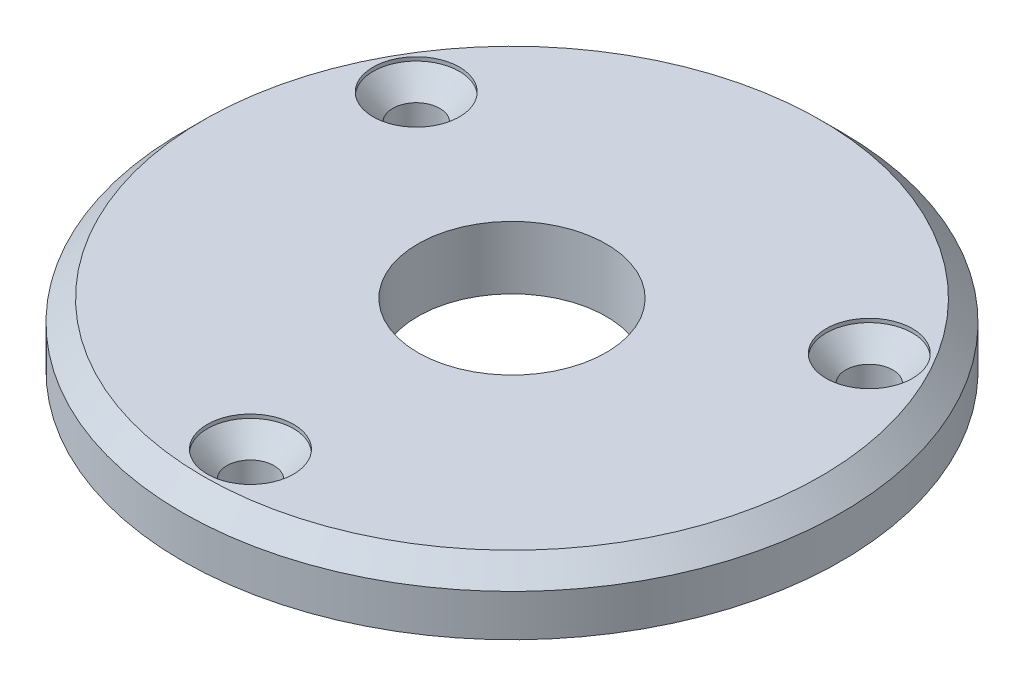
ISO-10303-21;
HEADER;
FILE_DESCRIPTION(('STEP AP214'),'2;1');
FILE_NAME('part.step','',(''),(''),'','','');
FILE_SCHEMA(('AUTOMOTIVE_DESIGN { 1 0 10303 214 1 1 1 1 }'));
ENDSEC;
DATA;
#1=APPLICATION_CONTEXT('core data for automotive mechanical design processes');
#2=APPLICATION_PROTOCOL_DEFINITION('international standard','automotive_design',2000,#1);
#3=PRODUCT_CONTEXT('',#1,'mechanical');
#4=PRODUCT('Part','Part','',(#3));
#5=PRODUCT_RELATED_PRODUCT_CATEGORY('part','',(#4));
#6=PRODUCT_DEFINITION_FORMATION('','',#4);
#7=PRODUCT_DEFINITION_CONTEXT('part definition',#1,'design');
#8=PRODUCT_DEFINITION('design','',#6,#7);
#9=PRODUCT_DEFINITION_SHAPE('','',#8);
#10=(LENGTH_UNIT() NAMED_UNIT(*) SI_UNIT(.MILLI.,.METRE.));
#11=(NAMED_UNIT(*) PLANE_ANGLE_UNIT() SI_UNIT($,.RADIAN.));
#12=(NAMED_UNIT(*) SI_UNIT($,.STERADIAN.) SOLID_ANGLE_UNIT());
#13=UNCERTAINTY_MEASURE_WITH_UNIT(LENGTH_MEASURE(1.E-05),#10,'distance_accuracy_value','');
#14=(GEOMETRIC_REPRESENTATION_CONTEXT(3) GLOBAL_UNCERTAINTY_ASSIGNED_CONTEXT((#13)) GLOBAL_UNIT_ASSIGNED_CONTEXT((#10,
#11,#12)) REPRESENTATION_CONTEXT('',''));
#15=CARTESIAN_POINT('',(0.,0.,0.));
#16=DIRECTION('',(0.,0.,1.));
#17=DIRECTION('',(1.,0.,0.));
#18=AXIS2_PLACEMENT_3D('',#15,#16,#17);
#19=CARTESIAN_POINT('',(0.,6.,0.));
#20=DIRECTION('',(0.,1.,0.));
#21=DIRECTION('',(0.,0.,1.));
#22=AXIS2_PLACEMENT_3D('',#19,#20,#21);
#23=PLANE('',#22);
#24=CARTESIAN_POINT('',(21.6506350946111,6.,-12.4999999999998));
#25=DIRECTION('',(0.,-1.,0.));
#26=DIRECTION('',(-0.866025403784443,0.,0.499999999999992));
#27=AXIS2_PLACEMENT_3D('',#24,#25,#26);
#28=CIRCLE('',#27,4.125);
#29=CARTESIAN_POINT('',(18.0782803040003,6.,-10.4374999999998));
#30=VERTEX_POINT('',#29);
#31=EDGE_CURVE('E85',#30,#30,#28,.T.);
#32=ORIENTED_EDGE('',*,*,#31,.T.);
#33=EDGE_LOOP('',(#32));
#34=FACE_BOUND('',#33,.T.);
#35=CARTESIAN_POINT('',(-21.6506350946109,6.,-12.5000000000001));
#36=DIRECTION('',(0.,-1.,0.));
#37=DIRECTION('',(0.866025403784436,0.,0.500000000000004));
#38=AXIS2_PLACEMENT_3D('',#35,#36,#37);
#39=CIRCLE('',#38,4.125);
#40=CARTESIAN_POINT('',(-18.0782803040001,6.,-10.4375000000001));
#41=VERTEX_POINT('',#40);
#42=EDGE_CURVE('E73',#41,#41,#39,.T.);
#43=ORIENTED_EDGE('',*,*,#42,.T.);
#44=EDGE_LOOP('',(#43));
#45=FACE_BOUND('',#44,.T.);
#46=CARTESIAN_POINT('',(0.,6.,25.));
#47=DIRECTION('',(0.,-1.,0.));
#48=DIRECTION('',(0.,0.,-1.));
#49=AXIS2_PLACEMENT_3D('',#46,#47,#48);
#50=CIRCLE('',#49,4.125);
#51=CARTESIAN_POINT('',(0.,6.,20.875));
#52=VERTEX_POINT('',#51);
#53=EDGE_CURVE('E53',#52,#52,#50,.T.);
#54=ORIENTED_EDGE('',*,*,#53,.T.);
#55=EDGE_LOOP('',(#54));
#56=FACE_BOUND('',#55,.T.);
#57=CARTESIAN_POINT('',(0.,6.,0.));
#58=DIRECTION('',(0.,1.,0.));
#59=DIRECTION('',(0.,0.,1.));
#60=AXIS2_PLACEMENT_3D('',#57,#58,#59);
#61=CIRCLE('',#60,29.5);
#62=CARTESIAN_POINT('',(0.,6.,29.5));
#63=VERTEX_POINT('',#62);
#64=EDGE_CURVE('E39',#63,#63,#61,.T.);
#65=ORIENTED_EDGE('',*,*,#64,.T.);
#66=EDGE_LOOP('',(#65));
#67=FACE_BOUND('',#66,.T.);
#68=CARTESIAN_POINT('',(0.,6.,0.));
#69=DIRECTION('',(0.,1.,0.));
#70=DIRECTION('',(0.,0.,1.));
#71=AXIS2_PLACEMENT_3D('',#68,#69,#70);
#72=CIRCLE('',#71,9.);
#73=CARTESIAN_POINT('',(0.,6.,9.));
#74=VERTEX_POINT('',#73);
#75=EDGE_CURVE('E47',#74,#74,#72,.T.);
#76=ORIENTED_EDGE('',*,*,#75,.F.);
#77=EDGE_LOOP('',(#76));
#78=FACE_BOUND('',#77,.T.);
#79=ADVANCED_FACE('F32',(#34,#45,#56,#67,#78),#23,.T.);
#80=CARTESIAN_POINT('',(0.,0.,0.));
#81=DIRECTION('',(0.,1.,0.));
#82=DIRECTION('',(0.,0.,1.));
#83=AXIS2_PLACEMENT_3D('',#80,#81,#82);
#84=PLANE('',#83);
#85=CARTESIAN_POINT('',(21.6506350946111,0.,-12.4999999999998));
#86=DIRECTION('',(0.,-1.,0.));
#87=DIRECTION('',(-0.866025403784443,0.,0.499999999999992));
#88=AXIS2_PLACEMENT_3D('',#85,#86,#87);
#89=CIRCLE('',#88,2.25);
#90=CARTESIAN_POINT('',(19.7020779360961,0.,-11.3749999999998));
#91=VERTEX_POINT('',#90);
#92=EDGE_CURVE('E88',#91,#91,#89,.T.);
#93=ORIENTED_EDGE('',*,*,#92,.F.);
#94=EDGE_LOOP('',(#93));
#95=FACE_BOUND('',#94,.T.);
#96=CARTESIAN_POINT('',(-21.6506350946109,0.,-12.5000000000001));
#97=DIRECTION('',(0.,-1.,0.));
#98=DIRECTION('',(0.866025403784436,0.,0.500000000000004));
#99=AXIS2_PLACEMENT_3D('',#96,#97,#98);
#100=CIRCLE('',#99,2.25);
#101=CARTESIAN_POINT('',(-19.7020779360959,0.,-11.3750000000001));
#102=VERTEX_POINT('',#101);
#103=EDGE_CURVE('E76',#102,#102,#100,.T.);
#104=ORIENTED_EDGE('',*,*,#103,.F.);
#105=EDGE_LOOP('',(#104));
#106=FACE_BOUND('',#105,.T.);
#107=CARTESIAN_POINT('',(0.,0.,25.));
#108=DIRECTION('',(0.,-1.,0.));
#109=DIRECTION('',(0.,0.,-1.));
#110=AXIS2_PLACEMENT_3D('',#107,#108,#109);
#111=CIRCLE('',#110,2.25);
#112=CARTESIAN_POINT('',(0.,0.,22.75));
#113=VERTEX_POINT('',#112);
#114=EDGE_CURVE('E64',#113,#113,#111,.T.);
#115=ORIENTED_EDGE('',*,*,#114,.F.);
#116=EDGE_LOOP('',(#115));
#117=FACE_BOUND('',#116,.T.);
#118=CARTESIAN_POINT('',(0.,0.,0.));
#119=DIRECTION('',(0.,1.,0.));
#120=DIRECTION('',(0.,0.,1.));
#121=AXIS2_PLACEMENT_3D('',#118,#119,#120);
#122=CIRCLE('',#121,31.5);
#123=CARTESIAN_POINT('',(0.,0.,31.5));
#124=VERTEX_POINT('',#123);
#125=EDGE_CURVE('E43',#124,#124,#122,.T.);
#126=ORIENTED_EDGE('',*,*,#125,.F.);
#127=EDGE_LOOP('',(#126));
#128=FACE_BOUND('',#127,.T.);
#129=CARTESIAN_POINT('',(0.,0.,0.));
#130=DIRECTION('',(0.,1.,0.));
#131=DIRECTION('',(0.,0.,1.));
#132=AXIS2_PLACEMENT_3D('',#129,#130,#131);
#133=CIRCLE('',#132,9.);
#134=CARTESIAN_POINT('',(0.,0.,9.));
#135=VERTEX_POINT('',#134);
#136=EDGE_CURVE('E50',#135,#135,#133,.T.);
#137=ORIENTED_EDGE('',*,*,#136,.T.);
#138=EDGE_LOOP('',(#137));
#139=FACE_BOUND('',#138,.T.);
#140=ADVANCED_FACE('F94',(#95,#106,#117,#128,#139),#84,.F.);
#141=CARTESIAN_POINT('',(0.,6.,0.));
#142=DIRECTION('',(0.,-1.,0.));
#143=DIRECTION('',(0.,0.,-1.));
#144=AXIS2_PLACEMENT_3D('',#141,#142,#143);
#145=CYLINDRICAL_SURFACE('',#144,31.5);
#146=CARTESIAN_POINT('',(0.,4.00000000000001,0.));
#147=DIRECTION('',(0.,1.,0.));
#148=DIRECTION('',(0.,0.,1.));
#149=AXIS2_PLACEMENT_3D('',#146,#147,#148);
#150=CIRCLE('',#149,31.5);
#151=CARTESIAN_POINT('',(0.,4.00000000000001,31.5));
#152=VERTEX_POINT('',#151);
#153=EDGE_CURVE('E10',#152,#152,#150,.F.);
#154=ORIENTED_EDGE('',*,*,#153,.T.);
#155=EDGE_LOOP('',(#154));
#156=FACE_BOUND('',#155,.T.);
#157=ORIENTED_EDGE('',*,*,#125,.T.);
#158=EDGE_LOOP('',(#157));
#159=FACE_BOUND('',#158,.T.);
#160=ADVANCED_FACE('F97',(#156,#159),#145,.T.);
#161=CARTESIAN_POINT('',(0.,6.,0.));
#162=DIRECTION('',(0.,-1.,0.));
#163=DIRECTION('',(0.,0.,-1.));
#164=AXIS2_PLACEMENT_3D('',#161,#162,#163);
#165=CYLINDRICAL_SURFACE('',#164,9.);
#166=ORIENTED_EDGE('',*,*,#75,.T.);
#167=EDGE_LOOP('',(#166));
#168=FACE_BOUND('',#167,.T.);
#169=ORIENTED_EDGE('',*,*,#136,.F.);
#170=EDGE_LOOP('',(#169));
#171=FACE_BOUND('',#170,.T.);
#172=ADVANCED_FACE('F107',(#168,#171),#165,.F.);
#173=CARTESIAN_POINT('',(0.,6.,0.));
#174=DIRECTION('',(0.,-1.,0.));
#175=DIRECTION('',(0.,0.,-1.));
#176=AXIS2_PLACEMENT_3D('',#173,#174,#175);
#177=CONICAL_SURFACE('',#176,29.5,0.78539816339745);
#178=ORIENTED_EDGE('',*,*,#153,.F.);
#179=EDGE_LOOP('',(#178));
#180=FACE_BOUND('',#179,.T.);
#181=ORIENTED_EDGE('',*,*,#64,.F.);
#182=EDGE_LOOP('',(#181));
#183=FACE_BOUND('',#182,.T.);
#184=ADVANCED_FACE('F34',(#180,#183),#177,.T.);
#185=CARTESIAN_POINT('',(0.,0.,25.));
#186=DIRECTION('',(0.,-1.,0.));
#187=DIRECTION('',(0.,0.,-1.));
#188=AXIS2_PLACEMENT_3D('',#185,#186,#187);
#189=CYLINDRICAL_SURFACE('',#188,4.125);
#190=ORIENTED_EDGE('',*,*,#53,.F.);
#191=EDGE_LOOP('',(#190));
#192=FACE_BOUND('',#191,.T.);
#193=CARTESIAN_POINT('',(0.,5.64,25.));
#194=DIRECTION('',(0.,-1.,0.));
#195=DIRECTION('',(0.,0.,-1.));
#196=AXIS2_PLACEMENT_3D('',#193,#194,#195);
#197=CIRCLE('',#196,4.125);
#198=CARTESIAN_POINT('',(0.,5.64,20.875));
#199=VERTEX_POINT('',#198);
#200=EDGE_CURVE('E58',#199,#199,#197,.T.);
#201=ORIENTED_EDGE('',*,*,#200,.T.);
#202=EDGE_LOOP('',(#201));
#203=FACE_BOUND('',#202,.T.);
#204=ADVANCED_FACE('F115',(#192,#203),#189,.F.);
#205=CARTESIAN_POINT('',(0.,3.52,25.));
#206=DIRECTION('',(0.,1.,0.));
#207=DIRECTION('',(0.,0.,1.));
#208=AXIS2_PLACEMENT_3D('',#205,#206,#207);
#209=CONICAL_SURFACE('',#208,2.25,0.724148214398049);
#210=ORIENTED_EDGE('',*,*,#200,.F.);
#211=EDGE_LOOP('',(#210));
#212=FACE_BOUND('',#211,.T.);
#213=CARTESIAN_POINT('',(0.,3.52,25.));
#214=DIRECTION('',(0.,-1.,0.));
#215=DIRECTION('',(0.,0.,-1.));
#216=AXIS2_PLACEMENT_3D('',#213,#214,#215);
#217=CIRCLE('',#216,2.25);
#218=CARTESIAN_POINT('',(0.,3.52,22.75));
#219=VERTEX_POINT('',#218);
#220=EDGE_CURVE('E61',#219,#219,#217,.T.);
#221=ORIENTED_EDGE('',*,*,#220,.T.);
#222=EDGE_LOOP('',(#221));
#223=FACE_BOUND('',#222,.T.);
#224=ADVANCED_FACE('F133',(#212,#223),#209,.F.);
#225=CARTESIAN_POINT('',(0.,0.,25.));
#226=DIRECTION('',(0.,-1.,0.));
#227=DIRECTION('',(0.,0.,-1.));
#228=AXIS2_PLACEMENT_3D('',#225,#226,#227);
#229=CYLINDRICAL_SURFACE('',#228,2.25);
#230=ORIENTED_EDGE('',*,*,#220,.F.);
#231=EDGE_LOOP('',(#230));
#232=FACE_BOUND('',#231,.T.);
#233=ORIENTED_EDGE('',*,*,#114,.T.);
#234=EDGE_LOOP('',(#233));
#235=FACE_BOUND('',#234,.T.);
#236=ADVANCED_FACE('F138',(#232,#235),#229,.F.);
#237=CARTESIAN_POINT('',(-21.6506350946109,0.,-12.5000000000001));
#238=DIRECTION('',(0.,-1.,0.));
#239=DIRECTION('',(0.866025403784436,0.,0.500000000000004));
#240=AXIS2_PLACEMENT_3D('',#237,#238,#239);
#241=CYLINDRICAL_SURFACE('',#240,4.125);
#242=ORIENTED_EDGE('',*,*,#42,.F.);
#243=EDGE_LOOP('',(#242));
#244=FACE_BOUND('',#243,.T.);
#245=CARTESIAN_POINT('',(-21.6506350946109,5.64,-12.5000000000001));
#246=DIRECTION('',(0.,-1.,0.));
#247=DIRECTION('',(0.866025403784436,0.,0.500000000000004));
#248=AXIS2_PLACEMENT_3D('',#245,#246,#247);
#249=CIRCLE('',#248,4.125);
#250=CARTESIAN_POINT('',(-18.0782803040001,5.64,-10.4375000000001));
#251=VERTEX_POINT('',#250);
#252=EDGE_CURVE('E67',#251,#251,#249,.T.);
#253=ORIENTED_EDGE('',*,*,#252,.T.);
#254=EDGE_LOOP('',(#253));
#255=FACE_BOUND('',#254,.T.);
#256=ADVANCED_FACE('F144',(#244,#255),#241,.F.);
#257=CARTESIAN_POINT('',(-21.6506350946109,3.52,-12.5000000000001));
#258=DIRECTION('',(0.,1.,0.));
#259=DIRECTION('',(-0.866025403784436,0.,-0.500000000000004));
#260=AXIS2_PLACEMENT_3D('',#257,#258,#259);
#261=CONICAL_SURFACE('',#260,2.25,0.724148214398049);
#262=ORIENTED_EDGE('',*,*,#252,.F.);
#263=EDGE_LOOP('',(#262));
#264=FACE_BOUND('',#263,.T.);
#265=CARTESIAN_POINT('',(-21.6506350946109,3.52,-12.5000000000001));
#266=DIRECTION('',(0.,-1.,0.));
#267=DIRECTION('',(0.866025403784436,0.,0.500000000000004));
#268=AXIS2_PLACEMENT_3D('',#265,#266,#267);
#269=CIRCLE('',#268,2.25);
#270=CARTESIAN_POINT('',(-19.7020779360959,3.52,-11.3750000000001));
#271=VERTEX_POINT('',#270);
#272=EDGE_CURVE('E70',#271,#271,#269,.T.);
#273=ORIENTED_EDGE('',*,*,#272,.T.);
#274=EDGE_LOOP('',(#273));
#275=FACE_BOUND('',#274,.T.);
#276=ADVANCED_FACE('F149',(#264,#275),#261,.F.);
#277=CARTESIAN_POINT('',(-21.6506350946109,0.,-12.5000000000001));
#278=DIRECTION('',(0.,-1.,0.));
#279=DIRECTION('',(0.866025403784436,0.,0.500000000000004));
#280=AXIS2_PLACEMENT_3D('',#277,#278,#279);
#281=CYLINDRICAL_SURFACE('',#280,2.25);
#282=ORIENTED_EDGE('',*,*,#272,.F.);
#283=EDGE_LOOP('',(#282));
#284=FACE_BOUND('',#283,.T.);
#285=ORIENTED_EDGE('',*,*,#103,.T.);
#286=EDGE_LOOP('',(#285));
#287=FACE_BOUND('',#286,.T.);
#288=ADVANCED_FACE('F155',(#284,#287),#281,.F.);
#289=CARTESIAN_POINT('',(21.6506350946111,0.,-12.4999999999998));
#290=DIRECTION('',(0.,-1.,0.));
#291=DIRECTION('',(-0.866025403784443,0.,0.499999999999992));
#292=AXIS2_PLACEMENT_3D('',#289,#290,#291);
#293=CYLINDRICAL_SURFACE('',#292,4.125);
#294=ORIENTED_EDGE('',*,*,#31,.F.);
#295=EDGE_LOOP('',(#294));
#296=FACE_BOUND('',#295,.T.);
#297=CARTESIAN_POINT('',(21.6506350946111,5.64,-12.4999999999998));
#298=DIRECTION('',(0.,-1.,0.));
#299=DIRECTION('',(-0.866025403784443,0.,0.499999999999992));
#300=AXIS2_PLACEMENT_3D('',#297,#298,#299);
#301=CIRCLE('',#300,4.125);
#302=CARTESIAN_POINT('',(18.0782803040003,5.64,-10.4374999999998));
#303=VERTEX_POINT('',#302);
#304=EDGE_CURVE('E79',#303,#303,#301,.T.);
#305=ORIENTED_EDGE('',*,*,#304,.T.);
#306=EDGE_LOOP('',(#305));
#307=FACE_BOUND('',#306,.T.);
#308=ADVANCED_FACE('F159',(#296,#307),#293,.F.);
#309=CARTESIAN_POINT('',(21.6506350946111,3.52,-12.4999999999998));
#310=DIRECTION('',(0.,1.,0.));
#311=DIRECTION('',(0.866025403784443,0.,-0.499999999999992));
#312=AXIS2_PLACEMENT_3D('',#309,#310,#311);
#313=CONICAL_SURFACE('',#312,2.25,0.724148214398049);
#314=ORIENTED_EDGE('',*,*,#304,.F.);
#315=EDGE_LOOP('',(#314));
#316=FACE_BOUND('',#315,.T.);
#317=CARTESIAN_POINT('',(21.6506350946111,3.52,-12.4999999999998));
#318=DIRECTION('',(0.,-1.,0.));
#319=DIRECTION('',(-0.866025403784443,0.,0.499999999999992));
#320=AXIS2_PLACEMENT_3D('',#317,#318,#319);
#321=CIRCLE('',#320,2.25);
#322=CARTESIAN_POINT('',(19.7020779360961,3.52,-11.3749999999998));
#323=VERTEX_POINT('',#322);
#324=EDGE_CURVE('E82',#323,#323,#321,.T.);
#325=ORIENTED_EDGE('',*,*,#324,.T.);
#326=EDGE_LOOP('',(#325));
#327=FACE_BOUND('',#326,.T.);
#328=ADVANCED_FACE('F163',(#316,#327),#313,.F.);
#329=CARTESIAN_POINT('',(21.6506350946111,0.,-12.4999999999998));
#330=DIRECTION('',(0.,-1.,0.));
#331=DIRECTION('',(-0.866025403784443,0.,0.499999999999992));
#332=AXIS2_PLACEMENT_3D('',#329,#330,#331);
#333=CYLINDRICAL_SURFACE('',#332,2.25);
#334=ORIENTED_EDGE('',*,*,#324,.F.);
#335=EDGE_LOOP('',(#334));
#336=FACE_BOUND('',#335,.T.);
#337=ORIENTED_EDGE('',*,*,#92,.T.);
#338=EDGE_LOOP('',(#337));
#339=FACE_BOUND('',#338,.T.);
#340=ADVANCED_FACE('F92',(#336,#339),#333,.F.);
#341=CLOSED_SHELL('',(#79,#140,#160,#172,#184,#204,#224,#236,#256,#276,#288,#308,#328,#340));
#342=MANIFOLD_SOLID_BREP('B2',#341);
#343=ADVANCED_BREP_SHAPE_REPRESENTATION('',(#18,#342),#14);
#344=SHAPE_DEFINITION_REPRESENTATION(#9,#343);
ENDSEC;
END-ISO-10303-21;
